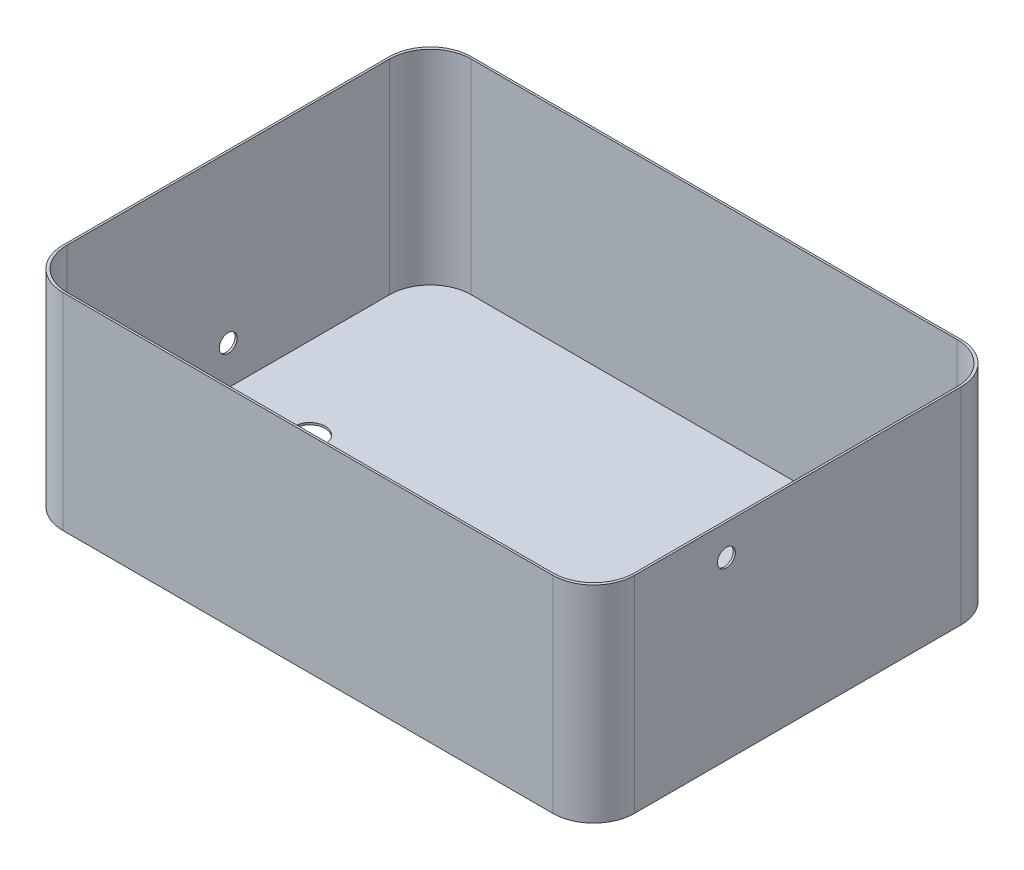
ISO-10303-21;
HEADER;
FILE_DESCRIPTION(('STEP AP214'),'2;1');
FILE_NAME('part.step','',(''),(''),'','','');
FILE_SCHEMA(('AUTOMOTIVE_DESIGN { 1 0 10303 214 1 1 1 1 }'));
ENDSEC;
DATA;
#1=APPLICATION_CONTEXT('core data for automotive mechanical design processes');
#2=APPLICATION_PROTOCOL_DEFINITION('international standard','automotive_design',2000,#1);
#3=PRODUCT_CONTEXT('',#1,'mechanical');
#4=PRODUCT('Part','Part','',(#3));
#5=PRODUCT_RELATED_PRODUCT_CATEGORY('part','',(#4));
#6=PRODUCT_DEFINITION_FORMATION('','',#4);
#7=PRODUCT_DEFINITION_CONTEXT('part definition',#1,'design');
#8=PRODUCT_DEFINITION('design','',#6,#7);
#9=PRODUCT_DEFINITION_SHAPE('','',#8);
#10=(LENGTH_UNIT() NAMED_UNIT(*) SI_UNIT(.MILLI.,.METRE.));
#11=(NAMED_UNIT(*) PLANE_ANGLE_UNIT() SI_UNIT($,.RADIAN.));
#12=(NAMED_UNIT(*) SI_UNIT($,.STERADIAN.) SOLID_ANGLE_UNIT());
#13=UNCERTAINTY_MEASURE_WITH_UNIT(LENGTH_MEASURE(1.E-05),#10,'distance_accuracy_value','');
#14=(GEOMETRIC_REPRESENTATION_CONTEXT(3) GLOBAL_UNCERTAINTY_ASSIGNED_CONTEXT((#13)) GLOBAL_UNIT_ASSIGNED_CONTEXT((#10,
#11,#12)) REPRESENTATION_CONTEXT('',''));
#15=CARTESIAN_POINT('',(0.,0.,0.));
#16=DIRECTION('',(0.,0.,1.));
#17=DIRECTION('',(1.,0.,0.));
#18=AXIS2_PLACEMENT_3D('',#15,#16,#17);
#19=CARTESIAN_POINT('',(0.,254.,0.));
#20=DIRECTION('',(0.,-1.,0.));
#21=DIRECTION('',(0.,0.,-1.));
#22=AXIS2_PLACEMENT_3D('',#19,#20,#21);
#23=PLANE('',#22);
#24=DIRECTION('',(0.,0.,-1.));
#25=VECTOR('',#24,1.);
#26=CARTESIAN_POINT('',(355.6,254.,254.));
#27=LINE('',#26,#25);
#28=CARTESIAN_POINT('',(355.6,254.,203.2));
#29=VERTEX_POINT('',#28);
#30=CARTESIAN_POINT('',(355.6,254.,-203.2));
#31=VERTEX_POINT('',#30);
#32=EDGE_CURVE('E242',#29,#31,#27,.T.);
#33=ORIENTED_EDGE('',*,*,#32,.T.);
#34=CARTESIAN_POINT('',(304.8,254.,-203.2));
#35=DIRECTION('',(0.,-1.,0.));
#36=DIRECTION('',(0.,0.,-1.));
#37=AXIS2_PLACEMENT_3D('',#34,#35,#36);
#38=CIRCLE('',#37,50.8);
#39=CARTESIAN_POINT('',(304.8,254.,-254.));
#40=VERTEX_POINT('',#39);
#41=EDGE_CURVE('E11',#31,#40,#38,.F.);
#42=ORIENTED_EDGE('',*,*,#41,.T.);
#43=DIRECTION('',(-1.,0.,0.));
#44=VECTOR('',#43,1.);
#45=CARTESIAN_POINT('',(-355.6,254.,-254.));
#46=LINE('',#45,#44);
#47=CARTESIAN_POINT('',(-304.8,254.,-254.));
#48=VERTEX_POINT('',#47);
#49=EDGE_CURVE('E253',#40,#48,#46,.T.);
#50=ORIENTED_EDGE('',*,*,#49,.T.);
#51=CARTESIAN_POINT('',(-304.8,254.,-203.2));
#52=DIRECTION('',(0.,-1.,0.));
#53=DIRECTION('',(0.,0.,-1.));
#54=AXIS2_PLACEMENT_3D('',#51,#52,#53);
#55=CIRCLE('',#54,50.8);
#56=CARTESIAN_POINT('',(-355.6,254.,-203.2));
#57=VERTEX_POINT('',#56);
#58=EDGE_CURVE('E58',#48,#57,#55,.F.);
#59=ORIENTED_EDGE('',*,*,#58,.T.);
#60=DIRECTION('',(0.,0.,1.));
#61=VECTOR('',#60,1.);
#62=CARTESIAN_POINT('',(-355.6,254.,254.));
#63=LINE('',#62,#61);
#64=CARTESIAN_POINT('',(-355.6,254.,203.2));
#65=VERTEX_POINT('',#64);
#66=EDGE_CURVE('E181',#57,#65,#63,.T.);
#67=ORIENTED_EDGE('',*,*,#66,.T.);
#68=CARTESIAN_POINT('',(-304.8,254.,203.2));
#69=DIRECTION('',(0.,-1.,0.));
#70=DIRECTION('',(0.,0.,-1.));
#71=AXIS2_PLACEMENT_3D('',#68,#69,#70);
#72=CIRCLE('',#71,50.8);
#73=CARTESIAN_POINT('',(-304.8,254.,254.));
#74=VERTEX_POINT('',#73);
#75=EDGE_CURVE('E237',#65,#74,#72,.F.);
#76=ORIENTED_EDGE('',*,*,#75,.T.);
#77=DIRECTION('',(1.,0.,0.));
#78=VECTOR('',#77,1.);
#79=CARTESIAN_POINT('',(-355.6,254.,254.));
#80=LINE('',#79,#78);
#81=CARTESIAN_POINT('',(304.8,254.,254.));
#82=VERTEX_POINT('',#81);
#83=EDGE_CURVE('E176',#74,#82,#80,.T.);
#84=ORIENTED_EDGE('',*,*,#83,.T.);
#85=CARTESIAN_POINT('',(304.8,254.,203.2));
#86=DIRECTION('',(0.,-1.,0.));
#87=DIRECTION('',(0.,0.,-1.));
#88=AXIS2_PLACEMENT_3D('',#85,#86,#87);
#89=CIRCLE('',#88,50.8);
#90=EDGE_CURVE('E44',#82,#29,#89,.F.);
#91=ORIENTED_EDGE('',*,*,#90,.T.);
#92=EDGE_LOOP('',(#33,#42,#50,#59,#67,#76,#84,#91));
#93=FACE_BOUND('',#92,.T.);
#94=DIRECTION('',(0.,0.,-1.));
#95=VECTOR('',#94,1.);
#96=CARTESIAN_POINT('',(353.06,254.,251.46));
#97=LINE('',#96,#95);
#98=CARTESIAN_POINT('',(353.06,254.,200.66));
#99=VERTEX_POINT('',#98);
#100=CARTESIAN_POINT('',(353.06,254.,-200.66));
#101=VERTEX_POINT('',#100);
#102=EDGE_CURVE('E171',#99,#101,#97,.T.);
#103=ORIENTED_EDGE('',*,*,#102,.F.);
#104=CARTESIAN_POINT('',(302.26,254.,200.66));
#105=DIRECTION('',(0.,-1.,0.));
#106=DIRECTION('',(0.,0.,-1.));
#107=AXIS2_PLACEMENT_3D('',#104,#105,#106);
#108=CIRCLE('',#107,50.8);
#109=CARTESIAN_POINT('',(302.26,254.,251.46));
#110=VERTEX_POINT('',#109);
#111=EDGE_CURVE('E229',#99,#110,#108,.T.);
#112=ORIENTED_EDGE('',*,*,#111,.T.);
#113=DIRECTION('',(1.,0.,0.));
#114=VECTOR('',#113,1.);
#115=CARTESIAN_POINT('',(-353.06,254.,251.46));
#116=LINE('',#115,#114);
#117=CARTESIAN_POINT('',(-302.26,254.,251.46));
#118=VERTEX_POINT('',#117);
#119=EDGE_CURVE('E254',#118,#110,#116,.T.);
#120=ORIENTED_EDGE('',*,*,#119,.F.);
#121=CARTESIAN_POINT('',(-302.26,254.,200.66));
#122=DIRECTION('',(0.,-1.,0.));
#123=DIRECTION('',(0.,0.,-1.));
#124=AXIS2_PLACEMENT_3D('',#121,#122,#123);
#125=CIRCLE('',#124,50.8);
#126=CARTESIAN_POINT('',(-353.06,254.,200.66));
#127=VERTEX_POINT('',#126);
#128=EDGE_CURVE('E175',#118,#127,#125,.T.);
#129=ORIENTED_EDGE('',*,*,#128,.T.);
#130=DIRECTION('',(0.,0.,1.));
#131=VECTOR('',#130,1.);
#132=CARTESIAN_POINT('',(-353.06,254.,251.46));
#133=LINE('',#132,#131);
#134=CARTESIAN_POINT('',(-353.06,254.,-200.66));
#135=VERTEX_POINT('',#134);
#136=EDGE_CURVE('E281',#135,#127,#133,.T.);
#137=ORIENTED_EDGE('',*,*,#136,.F.);
#138=CARTESIAN_POINT('',(-302.26,254.,-200.66));
#139=DIRECTION('',(0.,-1.,0.));
#140=DIRECTION('',(0.,0.,-1.));
#141=AXIS2_PLACEMENT_3D('',#138,#139,#140);
#142=CIRCLE('',#141,50.8);
#143=CARTESIAN_POINT('',(-302.26,254.,-251.46));
#144=VERTEX_POINT('',#143);
#145=EDGE_CURVE('E232',#135,#144,#142,.T.);
#146=ORIENTED_EDGE('',*,*,#145,.T.);
#147=DIRECTION('',(-1.,0.,0.));
#148=VECTOR('',#147,1.);
#149=CARTESIAN_POINT('',(-353.06,254.,-251.46));
#150=LINE('',#149,#148);
#151=CARTESIAN_POINT('',(302.26,254.,-251.46));
#152=VERTEX_POINT('',#151);
#153=EDGE_CURVE('E278',#152,#144,#150,.T.);
#154=ORIENTED_EDGE('',*,*,#153,.F.);
#155=CARTESIAN_POINT('',(302.26,254.,-200.66));
#156=DIRECTION('',(0.,-1.,0.));
#157=DIRECTION('',(0.,0.,-1.));
#158=AXIS2_PLACEMENT_3D('',#155,#156,#157);
#159=CIRCLE('',#158,50.8);
#160=EDGE_CURVE('E234',#152,#101,#159,.T.);
#161=ORIENTED_EDGE('',*,*,#160,.T.);
#162=EDGE_LOOP('',(#103,#112,#120,#129,#137,#146,#154,#161));
#163=FACE_BOUND('',#162,.T.);
#164=ADVANCED_FACE('F36',(#93,#163),#23,.F.);
#165=CARTESIAN_POINT('',(355.6,254.,254.));
#166=DIRECTION('',(-1.,0.,0.));
#167=DIRECTION('',(0.,0.,1.));
#168=AXIS2_PLACEMENT_3D('',#165,#166,#167);
#169=PLANE('',#168);
#170=CARTESIAN_POINT('',(355.6,215.9,88.9));
#171=DIRECTION('',(1.,0.,0.));
#172=DIRECTION('',(0.,0.,-1.));
#173=AXIS2_PLACEMENT_3D('',#170,#171,#172);
#174=CIRCLE('',#173,11.1125);
#175=CARTESIAN_POINT('',(355.6,215.9,77.7875));
#176=VERTEX_POINT('',#175);
#177=EDGE_CURVE('E312',#176,#176,#174,.T.);
#178=ORIENTED_EDGE('',*,*,#177,.F.);
#179=EDGE_LOOP('',(#178));
#180=FACE_BOUND('',#179,.T.);
#181=DIRECTION('',(0.,0.,1.));
#182=VECTOR('',#181,1.);
#183=CARTESIAN_POINT('',(355.6,-2.54,254.));
#184=LINE('',#183,#182);
#185=CARTESIAN_POINT('',(355.6,-2.54,-203.2));
#186=VERTEX_POINT('',#185);
#187=CARTESIAN_POINT('',(355.6,-2.54,203.2));
#188=VERTEX_POINT('',#187);
#189=EDGE_CURVE('E263',#186,#188,#184,.T.);
#190=ORIENTED_EDGE('',*,*,#189,.F.);
#191=DIRECTION('',(0.,-1.,0.));
#192=VECTOR('',#191,1.);
#193=CARTESIAN_POINT('',(355.6,254.,-203.2));
#194=LINE('',#193,#192);
#195=EDGE_CURVE('E218',#186,#31,#194,.F.);
#196=ORIENTED_EDGE('',*,*,#195,.T.);
#197=ORIENTED_EDGE('',*,*,#32,.F.);
#198=DIRECTION('',(0.,-1.,0.));
#199=VECTOR('',#198,1.);
#200=CARTESIAN_POINT('',(355.6,254.,203.2));
#201=LINE('',#200,#199);
#202=EDGE_CURVE('E215',#29,#188,#201,.T.);
#203=ORIENTED_EDGE('',*,*,#202,.T.);
#204=EDGE_LOOP('',(#190,#196,#197,#203));
#205=FACE_BOUND('',#204,.T.);
#206=ADVANCED_FACE('F250',(#180,#205),#169,.F.);
#207=CARTESIAN_POINT('',(-355.6,254.,-254.));
#208=DIRECTION('',(0.,0.,1.));
#209=DIRECTION('',(1.,0.,0.));
#210=AXIS2_PLACEMENT_3D('',#207,#208,#209);
#211=PLANE('',#210);
#212=ORIENTED_EDGE('',*,*,#49,.F.);
#213=DIRECTION('',(0.,-1.,0.));
#214=VECTOR('',#213,1.);
#215=CARTESIAN_POINT('',(304.8,254.,-254.));
#216=LINE('',#215,#214);
#217=CARTESIAN_POINT('',(304.8,-2.54,-254.));
#218=VERTEX_POINT('',#217);
#219=EDGE_CURVE('E204',#40,#218,#216,.T.);
#220=ORIENTED_EDGE('',*,*,#219,.T.);
#221=DIRECTION('',(1.,0.,0.));
#222=VECTOR('',#221,1.);
#223=CARTESIAN_POINT('',(355.6,-2.54,-254.));
#224=LINE('',#223,#222);
#225=CARTESIAN_POINT('',(-304.8,-2.54,-254.));
#226=VERTEX_POINT('',#225);
#227=EDGE_CURVE('E272',#226,#218,#224,.T.);
#228=ORIENTED_EDGE('',*,*,#227,.F.);
#229=DIRECTION('',(0.,-1.,0.));
#230=VECTOR('',#229,1.);
#231=CARTESIAN_POINT('',(-304.8,254.,-254.));
#232=LINE('',#231,#230);
#233=EDGE_CURVE('E202',#226,#48,#232,.F.);
#234=ORIENTED_EDGE('',*,*,#233,.T.);
#235=EDGE_LOOP('',(#212,#220,#228,#234));
#236=FACE_BOUND('',#235,.T.);
#237=ADVANCED_FACE('F320',(#236),#211,.F.);
#238=CARTESIAN_POINT('',(-355.6,254.,254.));
#239=DIRECTION('',(1.,0.,0.));
#240=DIRECTION('',(0.,0.,-1.));
#241=AXIS2_PLACEMENT_3D('',#238,#239,#240);
#242=PLANE('',#241);
#243=CARTESIAN_POINT('',(-355.6,48.26,0.));
#244=DIRECTION('',(-1.,0.,0.));
#245=DIRECTION('',(0.,0.,1.));
#246=AXIS2_PLACEMENT_3D('',#243,#244,#245);
#247=CIRCLE('',#246,11.1124999999999);
#248=CARTESIAN_POINT('',(-355.6,48.26,11.1124999999999));
#249=VERTEX_POINT('',#248);
#250=EDGE_CURVE('E306',#249,#249,#247,.T.);
#251=ORIENTED_EDGE('',*,*,#250,.F.);
#252=EDGE_LOOP('',(#251));
#253=FACE_BOUND('',#252,.T.);
#254=DIRECTION('',(0.,0.,-1.));
#255=VECTOR('',#254,1.);
#256=CARTESIAN_POINT('',(-355.6,-2.54,254.));
#257=LINE('',#256,#255);
#258=CARTESIAN_POINT('',(-355.6,-2.54,203.2));
#259=VERTEX_POINT('',#258);
#260=CARTESIAN_POINT('',(-355.6,-2.54,-203.2));
#261=VERTEX_POINT('',#260);
#262=EDGE_CURVE('E293',#259,#261,#257,.T.);
#263=ORIENTED_EDGE('',*,*,#262,.F.);
#264=DIRECTION('',(0.,-1.,0.));
#265=VECTOR('',#264,1.);
#266=CARTESIAN_POINT('',(-355.6,254.,203.2));
#267=LINE('',#266,#265);
#268=EDGE_CURVE('E51',#259,#65,#267,.F.);
#269=ORIENTED_EDGE('',*,*,#268,.T.);
#270=ORIENTED_EDGE('',*,*,#66,.F.);
#271=DIRECTION('',(0.,-1.,0.));
#272=VECTOR('',#271,1.);
#273=CARTESIAN_POINT('',(-355.6,254.,-203.2));
#274=LINE('',#273,#272);
#275=EDGE_CURVE('E225',#57,#261,#274,.T.);
#276=ORIENTED_EDGE('',*,*,#275,.T.);
#277=EDGE_LOOP('',(#263,#269,#270,#276));
#278=FACE_BOUND('',#277,.T.);
#279=ADVANCED_FACE('F294',(#253,#278),#242,.F.);
#280=CARTESIAN_POINT('',(-355.6,254.,254.));
#281=DIRECTION('',(0.,0.,-1.));
#282=DIRECTION('',(-1.,0.,0.));
#283=AXIS2_PLACEMENT_3D('',#280,#281,#282);
#284=PLANE('',#283);
#285=DIRECTION('',(-1.,0.,0.));
#286=VECTOR('',#285,1.);
#287=CARTESIAN_POINT('',(355.6,-2.54,254.));
#288=LINE('',#287,#286);
#289=CARTESIAN_POINT('',(304.8,-2.54,254.));
#290=VERTEX_POINT('',#289);
#291=CARTESIAN_POINT('',(-304.8,-2.54,254.));
#292=VERTEX_POINT('',#291);
#293=EDGE_CURVE('E262',#290,#292,#288,.T.);
#294=ORIENTED_EDGE('',*,*,#293,.F.);
#295=DIRECTION('',(0.,-1.,0.));
#296=VECTOR('',#295,1.);
#297=CARTESIAN_POINT('',(304.8,254.,254.));
#298=LINE('',#297,#296);
#299=EDGE_CURVE('E223',#290,#82,#298,.F.);
#300=ORIENTED_EDGE('',*,*,#299,.T.);
#301=ORIENTED_EDGE('',*,*,#83,.F.);
#302=DIRECTION('',(0.,-1.,0.));
#303=VECTOR('',#302,1.);
#304=CARTESIAN_POINT('',(-304.8,254.,254.));
#305=LINE('',#304,#303);
#306=EDGE_CURVE('E220',#74,#292,#305,.T.);
#307=ORIENTED_EDGE('',*,*,#306,.T.);
#308=EDGE_LOOP('',(#294,#300,#301,#307));
#309=FACE_BOUND('',#308,.T.);
#310=ADVANCED_FACE('F265',(#309),#284,.F.);
#311=CARTESIAN_POINT('',(353.06,254.,251.46));
#312=DIRECTION('',(-1.,0.,0.));
#313=DIRECTION('',(0.,0.,1.));
#314=AXIS2_PLACEMENT_3D('',#311,#312,#313);
#315=PLANE('',#314);
#316=CARTESIAN_POINT('',(353.06,215.9,88.9));
#317=DIRECTION('',(-1.,0.,0.));
#318=DIRECTION('',(0.,0.,1.));
#319=AXIS2_PLACEMENT_3D('',#316,#317,#318);
#320=CIRCLE('',#319,11.1125);
#321=CARTESIAN_POINT('',(353.06,215.9,100.0125));
#322=VERTEX_POINT('',#321);
#323=EDGE_CURVE('E309',#322,#322,#320,.T.);
#324=ORIENTED_EDGE('',*,*,#323,.F.);
#325=EDGE_LOOP('',(#324));
#326=FACE_BOUND('',#325,.T.);
#327=DIRECTION('',(0.,0.,-1.));
#328=VECTOR('',#327,1.);
#329=CARTESIAN_POINT('',(353.06,0.,251.46));
#330=LINE('',#329,#328);
#331=CARTESIAN_POINT('',(353.06,0.,200.66));
#332=VERTEX_POINT('',#331);
#333=CARTESIAN_POINT('',(353.06,0.,-200.66));
#334=VERTEX_POINT('',#333);
#335=EDGE_CURVE('E267',#332,#334,#330,.T.);
#336=ORIENTED_EDGE('',*,*,#335,.F.);
#337=DIRECTION('',(0.,-1.,0.));
#338=VECTOR('',#337,1.);
#339=CARTESIAN_POINT('',(353.06,254.,200.66));
#340=LINE('',#339,#338);
#341=EDGE_CURVE('E191',#332,#99,#340,.F.);
#342=ORIENTED_EDGE('',*,*,#341,.T.);
#343=ORIENTED_EDGE('',*,*,#102,.T.);
#344=DIRECTION('',(0.,-1.,0.));
#345=VECTOR('',#344,1.);
#346=CARTESIAN_POINT('',(353.06,0.,-200.66));
#347=LINE('',#346,#345);
#348=EDGE_CURVE('E188',#101,#334,#347,.T.);
#349=ORIENTED_EDGE('',*,*,#348,.T.);
#350=EDGE_LOOP('',(#336,#342,#343,#349));
#351=FACE_BOUND('',#350,.T.);
#352=ADVANCED_FACE('F391',(#326,#351),#315,.T.);
#353=CARTESIAN_POINT('',(-353.06,254.,-251.46));
#354=DIRECTION('',(0.,0.,1.));
#355=DIRECTION('',(1.,0.,0.));
#356=AXIS2_PLACEMENT_3D('',#353,#354,#355);
#357=PLANE('',#356);
#358=ORIENTED_EDGE('',*,*,#153,.T.);
#359=DIRECTION('',(0.,-1.,0.));
#360=VECTOR('',#359,1.);
#361=CARTESIAN_POINT('',(-302.26,0.,-251.46));
#362=LINE('',#361,#360);
#363=CARTESIAN_POINT('',(-302.26,0.,-251.46));
#364=VERTEX_POINT('',#363);
#365=EDGE_CURVE('E199',#144,#364,#362,.T.);
#366=ORIENTED_EDGE('',*,*,#365,.T.);
#367=DIRECTION('',(-1.,0.,0.));
#368=VECTOR('',#367,1.);
#369=CARTESIAN_POINT('',(-353.06,0.,-251.46));
#370=LINE('',#369,#368);
#371=CARTESIAN_POINT('',(302.26,0.,-251.46));
#372=VERTEX_POINT('',#371);
#373=EDGE_CURVE('E270',#372,#364,#370,.T.);
#374=ORIENTED_EDGE('',*,*,#373,.F.);
#375=DIRECTION('',(0.,-1.,0.));
#376=VECTOR('',#375,1.);
#377=CARTESIAN_POINT('',(302.26,254.,-251.46));
#378=LINE('',#377,#376);
#379=EDGE_CURVE('E197',#372,#152,#378,.F.);
#380=ORIENTED_EDGE('',*,*,#379,.T.);
#381=EDGE_LOOP('',(#358,#366,#374,#380));
#382=FACE_BOUND('',#381,.T.);
#383=ADVANCED_FACE('F387',(#382),#357,.T.);
#384=CARTESIAN_POINT('',(-353.06,254.,251.46));
#385=DIRECTION('',(1.,0.,0.));
#386=DIRECTION('',(0.,0.,-1.));
#387=AXIS2_PLACEMENT_3D('',#384,#385,#386);
#388=PLANE('',#387);
#389=CARTESIAN_POINT('',(-353.06,48.26,0.));
#390=DIRECTION('',(1.,0.,0.));
#391=DIRECTION('',(0.,0.,-1.));
#392=AXIS2_PLACEMENT_3D('',#389,#390,#391);
#393=CIRCLE('',#392,11.1125);
#394=CARTESIAN_POINT('',(-353.06,48.26,-11.1125));
#395=VERTEX_POINT('',#394);
#396=EDGE_CURVE('E302',#395,#395,#393,.T.);
#397=ORIENTED_EDGE('',*,*,#396,.F.);
#398=EDGE_LOOP('',(#397));
#399=FACE_BOUND('',#398,.T.);
#400=ORIENTED_EDGE('',*,*,#136,.T.);
#401=DIRECTION('',(0.,-1.,0.));
#402=VECTOR('',#401,1.);
#403=CARTESIAN_POINT('',(-353.06,0.,200.66));
#404=LINE('',#403,#402);
#405=CARTESIAN_POINT('',(-353.06,0.,200.66));
#406=VERTEX_POINT('',#405);
#407=EDGE_CURVE('E195',#127,#406,#404,.T.);
#408=ORIENTED_EDGE('',*,*,#407,.T.);
#409=DIRECTION('',(0.,0.,1.));
#410=VECTOR('',#409,1.);
#411=CARTESIAN_POINT('',(-353.06,0.,251.46));
#412=LINE('',#411,#410);
#413=CARTESIAN_POINT('',(-353.06,0.,-200.66));
#414=VERTEX_POINT('',#413);
#415=EDGE_CURVE('E155',#414,#406,#412,.T.);
#416=ORIENTED_EDGE('',*,*,#415,.F.);
#417=DIRECTION('',(0.,-1.,0.));
#418=VECTOR('',#417,1.);
#419=CARTESIAN_POINT('',(-353.06,254.,-200.66));
#420=LINE('',#419,#418);
#421=EDGE_CURVE('E193',#414,#135,#420,.F.);
#422=ORIENTED_EDGE('',*,*,#421,.T.);
#423=EDGE_LOOP('',(#400,#408,#416,#422));
#424=FACE_BOUND('',#423,.T.);
#425=ADVANCED_FACE('F384',(#399,#424),#388,.T.);
#426=CARTESIAN_POINT('',(-353.06,254.,251.46));
#427=DIRECTION('',(0.,0.,-1.));
#428=DIRECTION('',(-1.,0.,0.));
#429=AXIS2_PLACEMENT_3D('',#426,#427,#428);
#430=PLANE('',#429);
#431=ORIENTED_EDGE('',*,*,#119,.T.);
#432=DIRECTION('',(0.,-1.,0.));
#433=VECTOR('',#432,1.);
#434=CARTESIAN_POINT('',(302.26,0.,251.46));
#435=LINE('',#434,#433);
#436=CARTESIAN_POINT('',(302.26,0.,251.46));
#437=VERTEX_POINT('',#436);
#438=EDGE_CURVE('E170',#110,#437,#435,.T.);
#439=ORIENTED_EDGE('',*,*,#438,.T.);
#440=DIRECTION('',(1.,0.,0.));
#441=VECTOR('',#440,1.);
#442=CARTESIAN_POINT('',(-353.06,0.,251.46));
#443=LINE('',#442,#441);
#444=CARTESIAN_POINT('',(-302.26,0.,251.46));
#445=VERTEX_POINT('',#444);
#446=EDGE_CURVE('E153',#445,#437,#443,.T.);
#447=ORIENTED_EDGE('',*,*,#446,.F.);
#448=DIRECTION('',(0.,-1.,0.));
#449=VECTOR('',#448,1.);
#450=CARTESIAN_POINT('',(-302.26,254.,251.46));
#451=LINE('',#450,#449);
#452=EDGE_CURVE('E167',#445,#118,#451,.F.);
#453=ORIENTED_EDGE('',*,*,#452,.T.);
#454=EDGE_LOOP('',(#431,#439,#447,#453));
#455=FACE_BOUND('',#454,.T.);
#456=ADVANCED_FACE('F166',(#455),#430,.T.);
#457=CARTESIAN_POINT('',(0.,0.,0.));
#458=DIRECTION('',(0.,1.,0.));
#459=DIRECTION('',(0.,0.,1.));
#460=AXIS2_PLACEMENT_3D('',#457,#458,#459);
#461=PLANE('',#460);
#462=CARTESIAN_POINT('',(-251.46,0.,0.));
#463=DIRECTION('',(0.,1.,0.));
#464=DIRECTION('',(0.,0.,1.));
#465=AXIS2_PLACEMENT_3D('',#462,#463,#464);
#466=CIRCLE('',#465,19.05);
#467=CARTESIAN_POINT('',(-251.46,0.,19.05));
#468=VERTEX_POINT('',#467);
#469=EDGE_CURVE('E298',#468,#468,#466,.T.);
#470=ORIENTED_EDGE('',*,*,#469,.F.);
#471=EDGE_LOOP('',(#470));
#472=FACE_BOUND('',#471,.T.);
#473=ORIENTED_EDGE('',*,*,#446,.T.);
#474=CARTESIAN_POINT('',(302.26,0.,200.66));
#475=DIRECTION('',(0.,1.,0.));
#476=DIRECTION('',(0.,0.,1.));
#477=AXIS2_PLACEMENT_3D('',#474,#475,#476);
#478=CIRCLE('',#477,50.8);
#479=EDGE_CURVE('E160',#437,#332,#478,.T.);
#480=ORIENTED_EDGE('',*,*,#479,.T.);
#481=ORIENTED_EDGE('',*,*,#335,.T.);
#482=CARTESIAN_POINT('',(302.26,0.,-200.66));
#483=DIRECTION('',(0.,1.,0.));
#484=DIRECTION('',(0.,0.,1.));
#485=AXIS2_PLACEMENT_3D('',#482,#483,#484);
#486=CIRCLE('',#485,50.8);
#487=EDGE_CURVE('E178',#334,#372,#486,.T.);
#488=ORIENTED_EDGE('',*,*,#487,.T.);
#489=ORIENTED_EDGE('',*,*,#373,.T.);
#490=CARTESIAN_POINT('',(-302.26,0.,-200.66));
#491=DIRECTION('',(0.,1.,0.));
#492=DIRECTION('',(0.,0.,1.));
#493=AXIS2_PLACEMENT_3D('',#490,#491,#492);
#494=CIRCLE('',#493,50.8);
#495=EDGE_CURVE('E161',#364,#414,#494,.T.);
#496=ORIENTED_EDGE('',*,*,#495,.T.);
#497=ORIENTED_EDGE('',*,*,#415,.T.);
#498=CARTESIAN_POINT('',(-302.26,0.,200.66));
#499=DIRECTION('',(0.,1.,0.));
#500=DIRECTION('',(0.,0.,1.));
#501=AXIS2_PLACEMENT_3D('',#498,#499,#500);
#502=CIRCLE('',#501,50.8);
#503=EDGE_CURVE('E150',#406,#445,#502,.T.);
#504=ORIENTED_EDGE('',*,*,#503,.T.);
#505=EDGE_LOOP('',(#473,#480,#481,#488,#489,#496,#497,#504));
#506=FACE_BOUND('',#505,.T.);
#507=ADVANCED_FACE('F152',(#472,#506),#461,.T.);
#508=CARTESIAN_POINT('',(0.,-2.54,0.));
#509=DIRECTION('',(0.,1.,0.));
#510=DIRECTION('',(0.,0.,1.));
#511=AXIS2_PLACEMENT_3D('',#508,#509,#510);
#512=PLANE('',#511);
#513=CARTESIAN_POINT('',(-251.46,-2.54,0.));
#514=DIRECTION('',(0.,1.,0.));
#515=DIRECTION('',(0.,0.,1.));
#516=AXIS2_PLACEMENT_3D('',#513,#514,#515);
#517=CIRCLE('',#516,19.05);
#518=CARTESIAN_POINT('',(-251.46,-2.54,19.05));
#519=VERTEX_POINT('',#518);
#520=EDGE_CURVE('E295',#519,#519,#517,.T.);
#521=ORIENTED_EDGE('',*,*,#520,.T.);
#522=EDGE_LOOP('',(#521));
#523=FACE_BOUND('',#522,.T.);
#524=ORIENTED_EDGE('',*,*,#227,.T.);
#525=CARTESIAN_POINT('',(304.8,-2.53999999999999,-203.2));
#526=DIRECTION('',(0.,1.,0.));
#527=DIRECTION('',(0.,0.,1.));
#528=AXIS2_PLACEMENT_3D('',#525,#526,#527);
#529=CIRCLE('',#528,50.8);
#530=EDGE_CURVE('E213',#218,#186,#529,.F.);
#531=ORIENTED_EDGE('',*,*,#530,.T.);
#532=ORIENTED_EDGE('',*,*,#189,.T.);
#533=CARTESIAN_POINT('',(304.8,-2.53999999999999,203.2));
#534=DIRECTION('',(0.,1.,0.));
#535=DIRECTION('',(0.,0.,1.));
#536=AXIS2_PLACEMENT_3D('',#533,#534,#535);
#537=CIRCLE('',#536,50.8);
#538=EDGE_CURVE('E211',#188,#290,#537,.F.);
#539=ORIENTED_EDGE('',*,*,#538,.T.);
#540=ORIENTED_EDGE('',*,*,#293,.T.);
#541=CARTESIAN_POINT('',(-304.8,-2.53999999999999,203.2));
#542=DIRECTION('',(0.,1.,0.));
#543=DIRECTION('',(0.,0.,1.));
#544=AXIS2_PLACEMENT_3D('',#541,#542,#543);
#545=CIRCLE('',#544,50.8);
#546=EDGE_CURVE('E209',#292,#259,#545,.F.);
#547=ORIENTED_EDGE('',*,*,#546,.T.);
#548=ORIENTED_EDGE('',*,*,#262,.T.);
#549=CARTESIAN_POINT('',(-304.8,-2.53999999999999,-203.2));
#550=DIRECTION('',(0.,1.,0.));
#551=DIRECTION('',(0.,0.,1.));
#552=AXIS2_PLACEMENT_3D('',#549,#550,#551);
#553=CIRCLE('',#552,50.8);
#554=EDGE_CURVE('E207',#261,#226,#553,.F.);
#555=ORIENTED_EDGE('',*,*,#554,.T.);
#556=EDGE_LOOP('',(#524,#531,#532,#539,#540,#547,#548,#555));
#557=FACE_BOUND('',#556,.T.);
#558=ADVANCED_FACE('F261',(#523,#557),#512,.F.);
#559=CARTESIAN_POINT('',(302.26,254.,200.66));
#560=DIRECTION('',(0.,1.,0.));
#561=DIRECTION('',(0.,0.,1.));
#562=AXIS2_PLACEMENT_3D('',#559,#560,#561);
#563=CYLINDRICAL_SURFACE('',#562,50.8);
#564=ORIENTED_EDGE('',*,*,#111,.F.);
#565=ORIENTED_EDGE('',*,*,#341,.F.);
#566=ORIENTED_EDGE('',*,*,#479,.F.);
#567=ORIENTED_EDGE('',*,*,#438,.F.);
#568=EDGE_LOOP('',(#564,#565,#566,#567));
#569=FACE_BOUND('',#568,.T.);
#570=ADVANCED_FACE('F333',(#569),#563,.F.);
#571=CARTESIAN_POINT('',(-302.26,254.,200.66));
#572=DIRECTION('',(0.,1.,0.));
#573=DIRECTION('',(0.,0.,1.));
#574=AXIS2_PLACEMENT_3D('',#571,#572,#573);
#575=CYLINDRICAL_SURFACE('',#574,50.8);
#576=ORIENTED_EDGE('',*,*,#128,.F.);
#577=ORIENTED_EDGE('',*,*,#452,.F.);
#578=ORIENTED_EDGE('',*,*,#503,.F.);
#579=ORIENTED_EDGE('',*,*,#407,.F.);
#580=EDGE_LOOP('',(#576,#577,#578,#579));
#581=FACE_BOUND('',#580,.T.);
#582=ADVANCED_FACE('F174',(#581),#575,.F.);
#583=CARTESIAN_POINT('',(-302.26,254.,-200.66));
#584=DIRECTION('',(0.,1.,0.));
#585=DIRECTION('',(0.,0.,1.));
#586=AXIS2_PLACEMENT_3D('',#583,#584,#585);
#587=CYLINDRICAL_SURFACE('',#586,50.8);
#588=ORIENTED_EDGE('',*,*,#145,.F.);
#589=ORIENTED_EDGE('',*,*,#421,.F.);
#590=ORIENTED_EDGE('',*,*,#495,.F.);
#591=ORIENTED_EDGE('',*,*,#365,.F.);
#592=EDGE_LOOP('',(#588,#589,#590,#591));
#593=FACE_BOUND('',#592,.T.);
#594=ADVANCED_FACE('F339',(#593),#587,.F.);
#595=CARTESIAN_POINT('',(302.26,254.,-200.66));
#596=DIRECTION('',(0.,1.,0.));
#597=DIRECTION('',(0.,0.,1.));
#598=AXIS2_PLACEMENT_3D('',#595,#596,#597);
#599=CYLINDRICAL_SURFACE('',#598,50.8);
#600=ORIENTED_EDGE('',*,*,#160,.F.);
#601=ORIENTED_EDGE('',*,*,#379,.F.);
#602=ORIENTED_EDGE('',*,*,#487,.F.);
#603=ORIENTED_EDGE('',*,*,#348,.F.);
#604=EDGE_LOOP('',(#600,#601,#602,#603));
#605=FACE_BOUND('',#604,.T.);
#606=ADVANCED_FACE('F342',(#605),#599,.F.);
#607=CARTESIAN_POINT('',(304.8,254.,-203.2));
#608=DIRECTION('',(0.,-1.,0.));
#609=DIRECTION('',(0.,0.,-1.));
#610=AXIS2_PLACEMENT_3D('',#607,#608,#609);
#611=CYLINDRICAL_SURFACE('',#610,50.8);
#612=ORIENTED_EDGE('',*,*,#41,.F.);
#613=ORIENTED_EDGE('',*,*,#195,.F.);
#614=ORIENTED_EDGE('',*,*,#530,.F.);
#615=ORIENTED_EDGE('',*,*,#219,.F.);
#616=EDGE_LOOP('',(#612,#613,#614,#615));
#617=FACE_BOUND('',#616,.T.);
#618=ADVANCED_FACE('F346',(#617),#611,.T.);
#619=CARTESIAN_POINT('',(304.8,254.,203.2));
#620=DIRECTION('',(0.,-1.,0.));
#621=DIRECTION('',(0.,0.,-1.));
#622=AXIS2_PLACEMENT_3D('',#619,#620,#621);
#623=CYLINDRICAL_SURFACE('',#622,50.8);
#624=ORIENTED_EDGE('',*,*,#90,.F.);
#625=ORIENTED_EDGE('',*,*,#299,.F.);
#626=ORIENTED_EDGE('',*,*,#538,.F.);
#627=ORIENTED_EDGE('',*,*,#202,.F.);
#628=EDGE_LOOP('',(#624,#625,#626,#627));
#629=FACE_BOUND('',#628,.T.);
#630=ADVANCED_FACE('F256',(#629),#623,.T.);
#631=CARTESIAN_POINT('',(-304.8,254.,203.2));
#632=DIRECTION('',(0.,-1.,0.));
#633=DIRECTION('',(0.,0.,-1.));
#634=AXIS2_PLACEMENT_3D('',#631,#632,#633);
#635=CYLINDRICAL_SURFACE('',#634,50.8);
#636=ORIENTED_EDGE('',*,*,#75,.F.);
#637=ORIENTED_EDGE('',*,*,#268,.F.);
#638=ORIENTED_EDGE('',*,*,#546,.F.);
#639=ORIENTED_EDGE('',*,*,#306,.F.);
#640=EDGE_LOOP('',(#636,#637,#638,#639));
#641=FACE_BOUND('',#640,.T.);
#642=ADVANCED_FACE('F291',(#641),#635,.T.);
#643=CARTESIAN_POINT('',(-304.8,254.,-203.2));
#644=DIRECTION('',(0.,-1.,0.));
#645=DIRECTION('',(0.,0.,-1.));
#646=AXIS2_PLACEMENT_3D('',#643,#644,#645);
#647=CYLINDRICAL_SURFACE('',#646,50.8);
#648=ORIENTED_EDGE('',*,*,#58,.F.);
#649=ORIENTED_EDGE('',*,*,#233,.F.);
#650=ORIENTED_EDGE('',*,*,#554,.F.);
#651=ORIENTED_EDGE('',*,*,#275,.F.);
#652=EDGE_LOOP('',(#648,#649,#650,#651));
#653=FACE_BOUND('',#652,.T.);
#654=ADVANCED_FACE('F38',(#653),#647,.T.);
#655=CARTESIAN_POINT('',(-251.46,-2.54,0.));
#656=DIRECTION('',(0.,1.,0.));
#657=DIRECTION('',(0.,0.,1.));
#658=AXIS2_PLACEMENT_3D('',#655,#656,#657);
#659=CYLINDRICAL_SURFACE('',#658,19.05);
#660=ORIENTED_EDGE('',*,*,#520,.F.);
#661=EDGE_LOOP('',(#660));
#662=FACE_BOUND('',#661,.T.);
#663=ORIENTED_EDGE('',*,*,#469,.T.);
#664=EDGE_LOOP('',(#663));
#665=FACE_BOUND('',#664,.T.);
#666=ADVANCED_FACE('F356',(#662,#665),#659,.F.);
#667=CARTESIAN_POINT('',(-355.6,48.26,0.));
#668=DIRECTION('',(-1.,0.,0.));
#669=DIRECTION('',(0.,0.,1.));
#670=AXIS2_PLACEMENT_3D('',#667,#668,#669);
#671=CYLINDRICAL_SURFACE('',#670,11.1125);
#672=ORIENTED_EDGE('',*,*,#250,.T.);
#673=EDGE_LOOP('',(#672));
#674=FACE_BOUND('',#673,.T.);
#675=ORIENTED_EDGE('',*,*,#396,.T.);
#676=EDGE_LOOP('',(#675));
#677=FACE_BOUND('',#676,.T.);
#678=ADVANCED_FACE('F361',(#674,#677),#671,.F.);
#679=CARTESIAN_POINT('',(355.6,215.9,88.9));
#680=DIRECTION('',(1.,0.,0.));
#681=DIRECTION('',(0.,0.,-1.));
#682=AXIS2_PLACEMENT_3D('',#679,#680,#681);
#683=CYLINDRICAL_SURFACE('',#682,11.1125);
#684=ORIENTED_EDGE('',*,*,#177,.T.);
#685=EDGE_LOOP('',(#684));
#686=FACE_BOUND('',#685,.T.);
#687=ORIENTED_EDGE('',*,*,#323,.T.);
#688=EDGE_LOOP('',(#687));
#689=FACE_BOUND('',#688,.T.);
#690=ADVANCED_FACE('F316',(#686,#689),#683,.F.);
#691=CLOSED_SHELL('',(#164,#206,#237,#279,#310,#352,#383,#425,#456,#507,#558,#570,#582,#594,
#606,#618,#630,#642,#654,#666,#678,#690));
#692=MANIFOLD_SOLID_BREP('B2',#691);
#693=ADVANCED_BREP_SHAPE_REPRESENTATION('',(#18,#692),#14);
#694=SHAPE_DEFINITION_REPRESENTATION(#9,#693);
ENDSEC;
END-ISO-10303-21;
